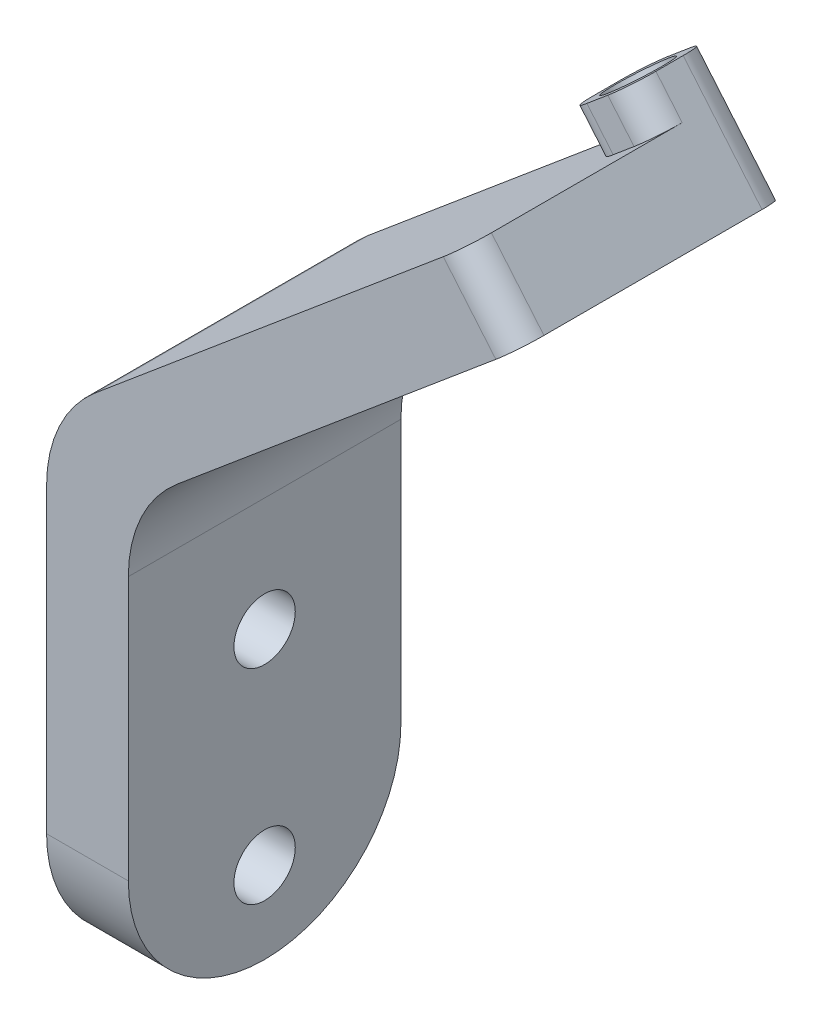
ISO-10303-21;
HEADER;
FILE_DESCRIPTION(('STEP AP214'),'2;1');
FILE_NAME('part.step','',(''),(''),'','','');
FILE_SCHEMA(('AUTOMOTIVE_DESIGN { 1 0 10303 214 1 1 1 1 }'));
ENDSEC;
DATA;
#1=APPLICATION_CONTEXT('core data for automotive mechanical design processes');
#2=APPLICATION_PROTOCOL_DEFINITION('international standard','automotive_design',2000,#1);
#3=PRODUCT_CONTEXT('',#1,'mechanical');
#4=PRODUCT('Part','Part','',(#3));
#5=PRODUCT_RELATED_PRODUCT_CATEGORY('part','',(#4));
#6=PRODUCT_DEFINITION_FORMATION('','',#4);
#7=PRODUCT_DEFINITION_CONTEXT('part definition',#1,'design');
#8=PRODUCT_DEFINITION('design','',#6,#7);
#9=PRODUCT_DEFINITION_SHAPE('','',#8);
#10=(LENGTH_UNIT() NAMED_UNIT(*) SI_UNIT(.MILLI.,.METRE.));
#11=(NAMED_UNIT(*) PLANE_ANGLE_UNIT() SI_UNIT($,.RADIAN.));
#12=(NAMED_UNIT(*) SI_UNIT($,.STERADIAN.) SOLID_ANGLE_UNIT());
#13=UNCERTAINTY_MEASURE_WITH_UNIT(LENGTH_MEASURE(1.E-05),#10,'distance_accuracy_value','');
#14=(GEOMETRIC_REPRESENTATION_CONTEXT(3) GLOBAL_UNCERTAINTY_ASSIGNED_CONTEXT((#13)) GLOBAL_UNIT_ASSIGNED_CONTEXT((#10,
#11,#12)) REPRESENTATION_CONTEXT('',''));
#15=CARTESIAN_POINT('',(0.,0.,0.));
#16=DIRECTION('',(0.,0.,1.));
#17=DIRECTION('',(1.,0.,0.));
#18=AXIS2_PLACEMENT_3D('',#15,#16,#17);
#19=CARTESIAN_POINT('',(0.,36.79784594893,20.));
#20=DIRECTION('',(0.642787609686538,-0.766044443118979,0.));
#21=DIRECTION('',(0.766044443118979,0.642787609686538,0.));
#22=AXIS2_PLACEMENT_3D('',#19,#20,#21);
#23=PLANE('',#22);
#24=DIRECTION('',(-0.766044443118979,-0.642787609686538,0.));
#25=VECTOR('',#24,1.);
#26=CARTESIAN_POINT('',(0.,36.79784594893,20.));
#27=LINE('',#26,#25);
#28=CARTESIAN_POINT('',(29.1096888385212,61.2237751170184,20.));
#29=VERTEX_POINT('',#28);
#30=CARTESIAN_POINT('',(3.57212390313463,39.7952137985698,20.));
#31=VERTEX_POINT('',#30);
#32=EDGE_CURVE('E310',#29,#31,#27,.T.);
#33=ORIENTED_EDGE('',*,*,#32,.F.);
#34=CARTESIAN_POINT('',(29.1096888385212,61.2237751170184,18.));
#35=DIRECTION('',(0.642787609686538,-0.766044443118979,0.));
#36=DIRECTION('',(0.766044443118979,0.642787609686538,0.));
#37=AXIS2_PLACEMENT_3D('',#34,#35,#36);
#38=CIRCLE('',#37,2.);
#39=CARTESIAN_POINT('',(30.6417777247592,62.5093503363915,18.));
#40=VERTEX_POINT('',#39);
#41=EDGE_CURVE('E47',#29,#40,#38,.F.);
#42=ORIENTED_EDGE('',*,*,#41,.T.);
#43=DIRECTION('',(0.,0.,-1.));
#44=VECTOR('',#43,1.);
#45=CARTESIAN_POINT('',(30.6417777247592,62.5093503363915,20.));
#46=LINE('',#45,#44);
#47=CARTESIAN_POINT('',(30.6417777247592,62.5093503363915,4.));
#48=VERTEX_POINT('',#47);
#49=EDGE_CURVE('E191',#40,#48,#46,.T.);
#50=ORIENTED_EDGE('',*,*,#49,.T.);
#51=CARTESIAN_POINT('',(29.1096888385212,61.2237751170184,4.));
#52=DIRECTION('',(0.642787609686538,-0.766044443118979,0.));
#53=DIRECTION('',(0.766044443118979,0.642787609686538,0.));
#54=AXIS2_PLACEMENT_3D('',#51,#52,#53);
#55=CIRCLE('',#54,2.);
#56=CARTESIAN_POINT('',(29.1096888385212,61.2237751170184,6.));
#57=VERTEX_POINT('',#56);
#58=EDGE_CURVE('E261',#48,#57,#55,.T.);
#59=ORIENTED_EDGE('',*,*,#58,.T.);
#60=DIRECTION('',(0.766044443118979,0.642787609686538,0.));
#61=VECTOR('',#60,1.);
#62=CARTESIAN_POINT('',(30.6417777247592,62.5093503363915,6.));
#63=LINE('',#62,#61);
#64=CARTESIAN_POINT('',(27.5775999522833,59.9381998976453,6.));
#65=VERTEX_POINT('',#64);
#66=EDGE_CURVE('E287',#65,#57,#63,.T.);
#67=ORIENTED_EDGE('',*,*,#66,.F.);
#68=CARTESIAN_POINT('',(27.5775999522833,59.9381998976454,4.));
#69=DIRECTION('',(0.642787609686538,-0.766044443118979,0.));
#70=DIRECTION('',(0.766044443118979,0.642787609686538,0.));
#71=AXIS2_PLACEMENT_3D('',#68,#69,#70);
#72=CIRCLE('',#71,2.);
#73=CARTESIAN_POINT('',(26.0455110660453,58.6526246782723,4.));
#74=VERTEX_POINT('',#73);
#75=EDGE_CURVE('E11',#65,#74,#72,.T.);
#76=ORIENTED_EDGE('',*,*,#75,.T.);
#77=DIRECTION('',(0.,0.,1.));
#78=VECTOR('',#77,1.);
#79=CARTESIAN_POINT('',(26.0455110660453,58.6526246782723,6.));
#80=LINE('',#79,#78);
#81=CARTESIAN_POINT('',(26.0455110660453,58.6526246782723,2.));
#82=VERTEX_POINT('',#81);
#83=EDGE_CURVE('E269',#82,#74,#80,.T.);
#84=ORIENTED_EDGE('',*,*,#83,.F.);
#85=CARTESIAN_POINT('',(27.5775999522833,59.9381998976454,2.));
#86=DIRECTION('',(0.642787609686538,-0.766044443118979,0.));
#87=DIRECTION('',(0.766044443118979,0.642787609686538,0.));
#88=AXIS2_PLACEMENT_3D('',#85,#86,#87);
#89=CIRCLE('',#88,2.);
#90=CARTESIAN_POINT('',(27.5775999522833,59.9381998976454,0.));
#91=VERTEX_POINT('',#90);
#92=EDGE_CURVE('E40',#82,#91,#89,.T.);
#93=ORIENTED_EDGE('',*,*,#92,.T.);
#94=DIRECTION('',(-0.766044443118979,-0.642787609686538,0.));
#95=VECTOR('',#94,1.);
#96=CARTESIAN_POINT('',(0.,36.79784594893,0.));
#97=LINE('',#96,#95);
#98=CARTESIAN_POINT('',(3.57212390313463,39.7952137985698,0.));
#99=VERTEX_POINT('',#98);
#100=EDGE_CURVE('E178',#91,#99,#97,.T.);
#101=ORIENTED_EDGE('',*,*,#100,.T.);
#102=DIRECTION('',(0.,0.,-1.));
#103=VECTOR('',#102,1.);
#104=CARTESIAN_POINT('',(3.57212390313463,39.7952137985698,20.));
#105=LINE('',#104,#103);
#106=EDGE_CURVE('E217',#99,#31,#105,.F.);
#107=ORIENTED_EDGE('',*,*,#106,.T.);
#108=EDGE_LOOP('',(#33,#42,#50,#59,#67,#76,#84,#93,#101,#107));
#109=FACE_BOUND('',#108,.T.);
#110=ADVANCED_FACE('F32',(#109),#23,.F.);
#111=CARTESIAN_POINT('',(6.,34.,20.));
#112=DIRECTION('',(-1.,0.,0.));
#113=DIRECTION('',(0.,-1.,0.));
#114=AXIS2_PLACEMENT_3D('',#111,#112,#113);
#115=PLANE('',#114);
#116=CARTESIAN_POINT('',(6.,21.,10.));
#117=DIRECTION('',(-1.,0.,0.));
#118=DIRECTION('',(0.,-1.,0.));
#119=AXIS2_PLACEMENT_3D('',#116,#117,#118);
#120=CIRCLE('',#119,2.25);
#121=CARTESIAN_POINT('',(6.,18.75,10.));
#122=VERTEX_POINT('',#121);
#123=EDGE_CURVE('E299',#122,#122,#120,.T.);
#124=ORIENTED_EDGE('',*,*,#123,.T.);
#125=EDGE_LOOP('',(#124));
#126=FACE_BOUND('',#125,.T.);
#127=CARTESIAN_POINT('',(6.,6.,10.));
#128=DIRECTION('',(-1.,0.,0.));
#129=DIRECTION('',(0.,-1.,0.));
#130=AXIS2_PLACEMENT_3D('',#127,#128,#129);
#131=CIRCLE('',#130,2.25);
#132=CARTESIAN_POINT('',(6.,3.75,10.));
#133=VERTEX_POINT('',#132);
#134=EDGE_CURVE('E184',#133,#133,#131,.T.);
#135=ORIENTED_EDGE('',*,*,#134,.T.);
#136=EDGE_LOOP('',(#135));
#137=FACE_BOUND('',#136,.T.);
#138=DIRECTION('',(0.,1.,0.));
#139=VECTOR('',#138,1.);
#140=CARTESIAN_POINT('',(6.,34.,0.));
#141=LINE('',#140,#139);
#142=CARTESIAN_POINT('',(6.,10.,0.));
#143=VERTEX_POINT('',#142);
#144=CARTESIAN_POINT('',(6.,29.33692341845,0.));
#145=VERTEX_POINT('',#144);
#146=EDGE_CURVE('E179',#143,#145,#141,.T.);
#147=ORIENTED_EDGE('',*,*,#146,.T.);
#148=DIRECTION('',(0.,0.,-1.));
#149=VECTOR('',#148,1.);
#150=CARTESIAN_POINT('',(6.,29.33692341845,20.));
#151=LINE('',#150,#149);
#152=CARTESIAN_POINT('',(6.,29.33692341845,20.));
#153=VERTEX_POINT('',#152);
#154=EDGE_CURVE('E158',#145,#153,#151,.F.);
#155=ORIENTED_EDGE('',*,*,#154,.T.);
#156=DIRECTION('',(0.,1.,0.));
#157=VECTOR('',#156,1.);
#158=CARTESIAN_POINT('',(6.,34.,20.));
#159=LINE('',#158,#157);
#160=CARTESIAN_POINT('',(6.,10.,20.));
#161=VERTEX_POINT('',#160);
#162=EDGE_CURVE('E190',#161,#153,#159,.T.);
#163=ORIENTED_EDGE('',*,*,#162,.F.);
#164=CARTESIAN_POINT('',(6.,10.,10.));
#165=DIRECTION('',(-1.,0.,0.));
#166=DIRECTION('',(0.,-1.,0.));
#167=AXIS2_PLACEMENT_3D('',#164,#165,#166);
#168=CIRCLE('',#167,10.);
#169=CARTESIAN_POINT('',(6.,0.,10.));
#170=VERTEX_POINT('',#169);
#171=EDGE_CURVE('E171',#161,#170,#168,.F.);
#172=ORIENTED_EDGE('',*,*,#171,.T.);
#173=CARTESIAN_POINT('',(6.,10.,10.));
#174=DIRECTION('',(-1.,0.,0.));
#175=DIRECTION('',(0.,-1.,0.));
#176=AXIS2_PLACEMENT_3D('',#173,#174,#175);
#177=CIRCLE('',#176,10.);
#178=EDGE_CURVE('E202',#170,#143,#177,.F.);
#179=ORIENTED_EDGE('',*,*,#178,.T.);
#180=EDGE_LOOP('',(#147,#155,#163,#172,#179));
#181=FACE_BOUND('',#180,.T.);
#182=ADVANCED_FACE('F327',(#126,#137,#181),#115,.F.);
#183=CARTESIAN_POINT('',(34.4985033828784,57.9130836776776,20.));
#184=DIRECTION('',(-0.642787609686538,0.766044443118979,0.));
#185=DIRECTION('',(-0.766044443118979,-0.642787609686538,0.));
#186=AXIS2_PLACEMENT_3D('',#183,#184,#185);
#187=PLANE('',#186);
#188=CARTESIAN_POINT('',(32.2003700535215,55.9847208486181,3.));
#189=DIRECTION('',(-0.642787609686538,0.766044443118979,0.));
#190=DIRECTION('',(-0.766044443118979,-0.642787609686538,0.));
#191=AXIS2_PLACEMENT_3D('',#188,#189,#190);
#192=CIRCLE('',#191,1.75);
#193=CARTESIAN_POINT('',(30.8597922780633,54.8598425316666,3.));
#194=VERTEX_POINT('',#193);
#195=EDGE_CURVE('E198',#194,#194,#192,.T.);
#196=ORIENTED_EDGE('',*,*,#195,.T.);
#197=EDGE_LOOP('',(#196));
#198=FACE_BOUND('',#197,.T.);
#199=DIRECTION('',(0.766044443118979,0.642787609686538,0.));
#200=VECTOR('',#199,1.);
#201=CARTESIAN_POINT('',(34.4985033828784,57.9130836776776,0.));
#202=LINE('',#201,#200);
#203=CARTESIAN_POINT('',(9.57212390313463,36.9973678496398,0.));
#204=VERTEX_POINT('',#203);
#205=CARTESIAN_POINT('',(32.9664144966404,56.6275084583046,0.));
#206=VERTEX_POINT('',#205);
#207=EDGE_CURVE('E168',#204,#206,#202,.T.);
#208=ORIENTED_EDGE('',*,*,#207,.T.);
#209=CARTESIAN_POINT('',(32.9664144966404,56.6275084583046,2.));
#210=DIRECTION('',(-0.642787609686538,0.766044443118979,0.));
#211=DIRECTION('',(-0.766044443118979,-0.642787609686538,0.));
#212=AXIS2_PLACEMENT_3D('',#209,#210,#211);
#213=CIRCLE('',#212,2.);
#214=CARTESIAN_POINT('',(34.4985033828784,57.9130836776776,2.));
#215=VERTEX_POINT('',#214);
#216=EDGE_CURVE('E256',#206,#215,#213,.F.);
#217=ORIENTED_EDGE('',*,*,#216,.T.);
#218=DIRECTION('',(0.,0.,-1.));
#219=VECTOR('',#218,1.);
#220=CARTESIAN_POINT('',(34.4985033828784,57.9130836776776,20.));
#221=LINE('',#220,#219);
#222=CARTESIAN_POINT('',(34.4985033828784,57.9130836776776,18.));
#223=VERTEX_POINT('',#222);
#224=EDGE_CURVE('E172',#223,#215,#221,.T.);
#225=ORIENTED_EDGE('',*,*,#224,.F.);
#226=CARTESIAN_POINT('',(32.9664144966404,56.6275084583046,18.));
#227=DIRECTION('',(-0.642787609686538,0.766044443118979,0.));
#228=DIRECTION('',(-0.766044443118979,-0.642787609686538,0.));
#229=AXIS2_PLACEMENT_3D('',#226,#227,#228);
#230=CIRCLE('',#229,2.);
#231=CARTESIAN_POINT('',(32.9664144966404,56.6275084583046,20.));
#232=VERTEX_POINT('',#231);
#233=EDGE_CURVE('E55',#223,#232,#230,.F.);
#234=ORIENTED_EDGE('',*,*,#233,.T.);
#235=DIRECTION('',(0.766044443118979,0.642787609686538,0.));
#236=VECTOR('',#235,1.);
#237=CARTESIAN_POINT('',(34.4985033828784,57.9130836776776,20.));
#238=LINE('',#237,#236);
#239=CARTESIAN_POINT('',(9.57212390313463,36.9973678496398,20.));
#240=VERTEX_POINT('',#239);
#241=EDGE_CURVE('E170',#240,#232,#238,.T.);
#242=ORIENTED_EDGE('',*,*,#241,.F.);
#243=DIRECTION('',(0.,0.,-1.));
#244=VECTOR('',#243,1.);
#245=CARTESIAN_POINT('',(9.57212390313463,36.9973678496398,0.));
#246=LINE('',#245,#244);
#247=EDGE_CURVE('E157',#240,#204,#246,.T.);
#248=ORIENTED_EDGE('',*,*,#247,.T.);
#249=EDGE_LOOP('',(#208,#217,#225,#234,#242,#248));
#250=FACE_BOUND('',#249,.T.);
#251=ADVANCED_FACE('F167',(#198,#250),#187,.F.);
#252=CARTESIAN_POINT('',(30.6417777247592,62.5093503363915,20.));
#253=DIRECTION('',(-0.76604444311898,-0.642787609686537,0.));
#254=DIRECTION('',(0.642787609686537,-0.76604444311898,0.));
#255=AXIS2_PLACEMENT_3D('',#252,#253,#254);
#256=PLANE('',#255);
#257=DIRECTION('',(0.,0.,-1.));
#258=VECTOR('',#257,1.);
#259=CARTESIAN_POINT('',(28.7134148956996,64.8074836657484,6.));
#260=LINE('',#259,#258);
#261=CARTESIAN_POINT('',(28.7134148956996,64.8074836657484,4.));
#262=VERTEX_POINT('',#261);
#263=CARTESIAN_POINT('',(28.7134148956996,64.8074836657484,2.));
#264=VERTEX_POINT('',#263);
#265=EDGE_CURVE('E283',#262,#264,#260,.T.);
#266=ORIENTED_EDGE('',*,*,#265,.F.);
#267=DIRECTION('',(0.642787609686537,-0.76604444311898,0.));
#268=VECTOR('',#267,1.);
#269=CARTESIAN_POINT('',(30.6417777247592,62.5093503363915,4.));
#270=LINE('',#269,#268);
#271=EDGE_CURVE('E231',#262,#48,#270,.T.);
#272=ORIENTED_EDGE('',*,*,#271,.T.);
#273=ORIENTED_EDGE('',*,*,#49,.F.);
#274=DIRECTION('',(-0.642787609686537,0.76604444311898,0.));
#275=VECTOR('',#274,1.);
#276=CARTESIAN_POINT('',(30.6417777247592,62.5093503363915,18.));
#277=LINE('',#276,#275);
#278=EDGE_CURVE('E224',#40,#223,#277,.F.);
#279=ORIENTED_EDGE('',*,*,#278,.T.);
#280=ORIENTED_EDGE('',*,*,#224,.T.);
#281=DIRECTION('',(-0.642787609686537,0.76604444311898,0.));
#282=VECTOR('',#281,1.);
#283=CARTESIAN_POINT('',(28.7134148956996,64.8074836657484,2.));
#284=LINE('',#283,#282);
#285=EDGE_CURVE('E228',#215,#264,#284,.T.);
#286=ORIENTED_EDGE('',*,*,#285,.T.);
#287=EDGE_LOOP('',(#266,#272,#273,#279,#280,#286));
#288=FACE_BOUND('',#287,.T.);
#289=ADVANCED_FACE('F331',(#288),#256,.F.);
#290=CARTESIAN_POINT('',(0.,0.,20.));
#291=DIRECTION('',(1.,0.,0.));
#292=DIRECTION('',(0.,0.,-1.));
#293=AXIS2_PLACEMENT_3D('',#290,#291,#292);
#294=PLANE('',#293);
#295=CARTESIAN_POINT('',(0.,21.,10.));
#296=DIRECTION('',(1.,0.,0.));
#297=DIRECTION('',(0.,1.,0.));
#298=AXIS2_PLACEMENT_3D('',#295,#296,#297);
#299=CIRCLE('',#298,2.25);
#300=CARTESIAN_POINT('',(0.,23.25,10.));
#301=VERTEX_POINT('',#300);
#302=EDGE_CURVE('E292',#301,#301,#299,.T.);
#303=ORIENTED_EDGE('',*,*,#302,.T.);
#304=EDGE_LOOP('',(#303));
#305=FACE_BOUND('',#304,.T.);
#306=CARTESIAN_POINT('',(0.,6.,10.));
#307=DIRECTION('',(1.,0.,0.));
#308=DIRECTION('',(0.,1.,0.));
#309=AXIS2_PLACEMENT_3D('',#306,#307,#308);
#310=CIRCLE('',#309,2.25);
#311=CARTESIAN_POINT('',(0.,8.25,10.));
#312=VERTEX_POINT('',#311);
#313=EDGE_CURVE('E302',#312,#312,#310,.T.);
#314=ORIENTED_EDGE('',*,*,#313,.T.);
#315=EDGE_LOOP('',(#314));
#316=FACE_BOUND('',#315,.T.);
#317=DIRECTION('',(0.,-1.,0.));
#318=VECTOR('',#317,1.);
#319=CARTESIAN_POINT('',(0.,0.,20.));
#320=LINE('',#319,#318);
#321=CARTESIAN_POINT('',(0.,32.13476936738,20.));
#322=VERTEX_POINT('',#321);
#323=CARTESIAN_POINT('',(0.,10.,20.));
#324=VERTEX_POINT('',#323);
#325=EDGE_CURVE('E193',#322,#324,#320,.T.);
#326=ORIENTED_EDGE('',*,*,#325,.F.);
#327=DIRECTION('',(0.,0.,-1.));
#328=VECTOR('',#327,1.);
#329=CARTESIAN_POINT('',(0.,32.13476936738,20.));
#330=LINE('',#329,#328);
#331=CARTESIAN_POINT('',(0.,32.13476936738,0.));
#332=VERTEX_POINT('',#331);
#333=EDGE_CURVE('E209',#322,#332,#330,.T.);
#334=ORIENTED_EDGE('',*,*,#333,.T.);
#335=DIRECTION('',(0.,-1.,0.));
#336=VECTOR('',#335,1.);
#337=CARTESIAN_POINT('',(0.,0.,0.));
#338=LINE('',#337,#336);
#339=CARTESIAN_POINT('',(0.,10.,0.));
#340=VERTEX_POINT('',#339);
#341=EDGE_CURVE('E182',#332,#340,#338,.T.);
#342=ORIENTED_EDGE('',*,*,#341,.T.);
#343=CARTESIAN_POINT('',(0.,10.,10.));
#344=DIRECTION('',(1.,0.,0.));
#345=DIRECTION('',(0.,0.,-1.));
#346=AXIS2_PLACEMENT_3D('',#343,#344,#345);
#347=CIRCLE('',#346,10.);
#348=CARTESIAN_POINT('',(0.,0.,10.));
#349=VERTEX_POINT('',#348);
#350=EDGE_CURVE('E207',#340,#349,#347,.F.);
#351=ORIENTED_EDGE('',*,*,#350,.T.);
#352=CARTESIAN_POINT('',(0.,10.,10.));
#353=DIRECTION('',(1.,0.,0.));
#354=DIRECTION('',(0.,0.,-1.));
#355=AXIS2_PLACEMENT_3D('',#352,#353,#354);
#356=CIRCLE('',#355,10.);
#357=EDGE_CURVE('E205',#349,#324,#356,.F.);
#358=ORIENTED_EDGE('',*,*,#357,.T.);
#359=EDGE_LOOP('',(#326,#334,#342,#351,#358));
#360=FACE_BOUND('',#359,.T.);
#361=ADVANCED_FACE('F372',(#305,#316,#360),#294,.F.);
#362=CARTESIAN_POINT('',(0.,0.,20.));
#363=DIRECTION('',(0.,0.,-1.));
#364=DIRECTION('',(-1.,0.,0.));
#365=AXIS2_PLACEMENT_3D('',#362,#363,#364);
#366=PLANE('',#365);
#367=ORIENTED_EDGE('',*,*,#241,.T.);
#368=DIRECTION('',(-0.642787609686537,0.76604444311898,0.));
#369=VECTOR('',#368,1.);
#370=CARTESIAN_POINT('',(47.2290908308488,39.6299126970032,20.));
#371=LINE('',#370,#369);
#372=EDGE_CURVE('E258',#232,#29,#371,.T.);
#373=ORIENTED_EDGE('',*,*,#372,.T.);
#374=ORIENTED_EDGE('',*,*,#32,.T.);
#375=CARTESIAN_POINT('',(10.,32.13476936738,20.));
#376=DIRECTION('',(0.,0.,-1.));
#377=DIRECTION('',(-1.,0.,0.));
#378=AXIS2_PLACEMENT_3D('',#375,#376,#377);
#379=CIRCLE('',#378,10.);
#380=EDGE_CURVE('E164',#31,#322,#379,.F.);
#381=ORIENTED_EDGE('',*,*,#380,.T.);
#382=ORIENTED_EDGE('',*,*,#325,.T.);
#383=DIRECTION('',(1.,0.,0.));
#384=VECTOR('',#383,1.);
#385=CARTESIAN_POINT('',(0.,10.,20.));
#386=LINE('',#385,#384);
#387=EDGE_CURVE('E220',#324,#161,#386,.T.);
#388=ORIENTED_EDGE('',*,*,#387,.T.);
#389=ORIENTED_EDGE('',*,*,#162,.T.);
#390=CARTESIAN_POINT('',(16.,29.33692341845,20.));
#391=DIRECTION('',(0.,0.,-1.));
#392=DIRECTION('',(-1.,0.,0.));
#393=AXIS2_PLACEMENT_3D('',#390,#391,#392);
#394=CIRCLE('',#393,10.);
#395=EDGE_CURVE('E163',#153,#240,#394,.T.);
#396=ORIENTED_EDGE('',*,*,#395,.T.);
#397=EDGE_LOOP('',(#367,#373,#374,#381,#382,#388,#389,#396));
#398=FACE_BOUND('',#397,.T.);
#399=ADVANCED_FACE('F315',(#398),#366,.F.);
#400=CARTESIAN_POINT('',(0.,0.,0.));
#401=DIRECTION('',(0.,0.,-1.));
#402=DIRECTION('',(-1.,0.,0.));
#403=AXIS2_PLACEMENT_3D('',#400,#401,#402);
#404=PLANE('',#403);
#405=ORIENTED_EDGE('',*,*,#100,.F.);
#406=DIRECTION('',(0.642787609686537,-0.76604444311898,0.));
#407=VECTOR('',#406,1.);
#408=CARTESIAN_POINT('',(25.6492371232237,62.2363332270023,0.));
#409=LINE('',#408,#407);
#410=CARTESIAN_POINT('',(25.6492371232237,62.2363332270023,0.));
#411=VERTEX_POINT('',#410);
#412=EDGE_CURVE('E253',#91,#411,#409,.F.);
#413=ORIENTED_EDGE('',*,*,#412,.T.);
#414=DIRECTION('',(-0.766044443118979,-0.642787609686538,0.));
#415=VECTOR('',#414,1.);
#416=CARTESIAN_POINT('',(28.7134148956996,64.8074836657484,0.));
#417=LINE('',#416,#415);
#418=CARTESIAN_POINT('',(27.1813260094616,63.5219084463754,0.));
#419=VERTEX_POINT('',#418);
#420=EDGE_CURVE('E275',#419,#411,#417,.T.);
#421=ORIENTED_EDGE('',*,*,#420,.F.);
#422=DIRECTION('',(-0.642787609686537,0.76604444311898,0.));
#423=VECTOR('',#422,1.);
#424=CARTESIAN_POINT('',(32.9664144966404,56.6275084583046,0.));
#425=LINE('',#424,#423);
#426=EDGE_CURVE('E177',#419,#206,#425,.F.);
#427=ORIENTED_EDGE('',*,*,#426,.T.);
#428=ORIENTED_EDGE('',*,*,#207,.F.);
#429=CARTESIAN_POINT('',(16.,29.33692341845,0.));
#430=DIRECTION('',(0.,0.,-1.));
#431=DIRECTION('',(-1.,0.,0.));
#432=AXIS2_PLACEMENT_3D('',#429,#430,#431);
#433=CIRCLE('',#432,10.);
#434=EDGE_CURVE('E153',#204,#145,#433,.F.);
#435=ORIENTED_EDGE('',*,*,#434,.T.);
#436=ORIENTED_EDGE('',*,*,#146,.F.);
#437=DIRECTION('',(1.,0.,0.));
#438=VECTOR('',#437,1.);
#439=CARTESIAN_POINT('',(0.,10.,0.));
#440=LINE('',#439,#438);
#441=EDGE_CURVE('E212',#143,#340,#440,.F.);
#442=ORIENTED_EDGE('',*,*,#441,.T.);
#443=ORIENTED_EDGE('',*,*,#341,.F.);
#444=CARTESIAN_POINT('',(10.,32.13476936738,0.));
#445=DIRECTION('',(0.,0.,-1.));
#446=DIRECTION('',(-1.,0.,0.));
#447=AXIS2_PLACEMENT_3D('',#444,#445,#446);
#448=CIRCLE('',#447,10.);
#449=EDGE_CURVE('E215',#332,#99,#448,.T.);
#450=ORIENTED_EDGE('',*,*,#449,.T.);
#451=EDGE_LOOP('',(#405,#413,#421,#427,#428,#435,#436,#442,#443,#450));
#452=FACE_BOUND('',#451,.T.);
#453=ADVANCED_FACE('F174',(#452),#404,.T.);
#454=CARTESIAN_POINT('',(0.,6.,10.));
#455=DIRECTION('',(1.,0.,0.));
#456=DIRECTION('',(0.,1.,0.));
#457=AXIS2_PLACEMENT_3D('',#454,#455,#456);
#458=CYLINDRICAL_SURFACE('',#457,2.25);
#459=ORIENTED_EDGE('',*,*,#313,.F.);
#460=EDGE_LOOP('',(#459));
#461=FACE_BOUND('',#460,.T.);
#462=ORIENTED_EDGE('',*,*,#134,.F.);
#463=EDGE_LOOP('',(#462));
#464=FACE_BOUND('',#463,.T.);
#465=ADVANCED_FACE('F360',(#461,#464),#458,.F.);
#466=CARTESIAN_POINT('',(0.,21.,10.));
#467=DIRECTION('',(1.,0.,0.));
#468=DIRECTION('',(0.,1.,0.));
#469=AXIS2_PLACEMENT_3D('',#466,#467,#468);
#470=CYLINDRICAL_SURFACE('',#469,2.25);
#471=ORIENTED_EDGE('',*,*,#302,.F.);
#472=EDGE_LOOP('',(#471));
#473=FACE_BOUND('',#472,.T.);
#474=ORIENTED_EDGE('',*,*,#123,.F.);
#475=EDGE_LOOP('',(#474));
#476=FACE_BOUND('',#475,.T.);
#477=ADVANCED_FACE('F353',(#473,#476),#470,.F.);
#478=CARTESIAN_POINT('',(24.1171482369857,60.9507580076292,6.));
#479=DIRECTION('',(0.76604444311898,0.642787609686537,0.));
#480=DIRECTION('',(-0.642787609686537,0.76604444311898,0.));
#481=AXIS2_PLACEMENT_3D('',#478,#479,#480);
#482=PLANE('',#481);
#483=DIRECTION('',(0.,0.,1.));
#484=VECTOR('',#483,1.);
#485=CARTESIAN_POINT('',(24.1171482369857,60.9507580076292,6.));
#486=LINE('',#485,#484);
#487=CARTESIAN_POINT('',(24.1171482369857,60.9507580076292,2.));
#488=VERTEX_POINT('',#487);
#489=CARTESIAN_POINT('',(24.1171482369857,60.9507580076292,4.));
#490=VERTEX_POINT('',#489);
#491=EDGE_CURVE('E282',#488,#490,#486,.T.);
#492=ORIENTED_EDGE('',*,*,#491,.F.);
#493=DIRECTION('',(0.642787609686537,-0.76604444311898,0.));
#494=VECTOR('',#493,1.);
#495=CARTESIAN_POINT('',(26.0455110660453,58.6526246782723,2.));
#496=LINE('',#495,#494);
#497=EDGE_CURVE('E249',#488,#82,#496,.T.);
#498=ORIENTED_EDGE('',*,*,#497,.T.);
#499=ORIENTED_EDGE('',*,*,#83,.T.);
#500=DIRECTION('',(0.642787609686537,-0.76604444311898,0.));
#501=VECTOR('',#500,1.);
#502=CARTESIAN_POINT('',(24.1171482369857,60.9507580076292,4.));
#503=LINE('',#502,#501);
#504=EDGE_CURVE('E247',#74,#490,#503,.F.);
#505=ORIENTED_EDGE('',*,*,#504,.T.);
#506=EDGE_LOOP('',(#492,#498,#499,#505));
#507=FACE_BOUND('',#506,.T.);
#508=ADVANCED_FACE('F351',(#507),#482,.F.);
#509=CARTESIAN_POINT('',(28.7134148956996,64.8074836657484,6.));
#510=DIRECTION('',(0.,0.,-1.));
#511=DIRECTION('',(-1.,0.,0.));
#512=AXIS2_PLACEMENT_3D('',#509,#510,#511);
#513=PLANE('',#512);
#514=ORIENTED_EDGE('',*,*,#66,.T.);
#515=DIRECTION('',(0.642787609686537,-0.76604444311898,0.));
#516=VECTOR('',#515,1.);
#517=CARTESIAN_POINT('',(27.1813260094616,63.5219084463754,6.));
#518=LINE('',#517,#516);
#519=CARTESIAN_POINT('',(27.1813260094616,63.5219084463754,6.));
#520=VERTEX_POINT('',#519);
#521=EDGE_CURVE('E237',#57,#520,#518,.F.);
#522=ORIENTED_EDGE('',*,*,#521,.T.);
#523=DIRECTION('',(0.766044443118979,0.642787609686538,0.));
#524=VECTOR('',#523,1.);
#525=CARTESIAN_POINT('',(28.7134148956996,64.8074836657484,6.));
#526=LINE('',#525,#524);
#527=CARTESIAN_POINT('',(25.6492371232237,62.2363332270023,6.));
#528=VERTEX_POINT('',#527);
#529=EDGE_CURVE('E285',#528,#520,#526,.T.);
#530=ORIENTED_EDGE('',*,*,#529,.F.);
#531=DIRECTION('',(0.642787609686537,-0.76604444311898,0.));
#532=VECTOR('',#531,1.);
#533=CARTESIAN_POINT('',(25.6492371232237,62.2363332270023,6.));
#534=LINE('',#533,#532);
#535=EDGE_CURVE('E234',#528,#65,#534,.T.);
#536=ORIENTED_EDGE('',*,*,#535,.T.);
#537=EDGE_LOOP('',(#514,#522,#530,#536));
#538=FACE_BOUND('',#537,.T.);
#539=ADVANCED_FACE('F344',(#538),#513,.F.);
#540=CARTESIAN_POINT('',(-20.0477648213871,23.891995749372,0.));
#541=DIRECTION('',(-0.642787609686538,0.766044443118979,0.));
#542=DIRECTION('',(-0.766044443118979,-0.642787609686538,0.));
#543=AXIS2_PLACEMENT_3D('',#540,#541,#542);
#544=PLANE('',#543);
#545=CARTESIAN_POINT('',(26.4152815663427,62.8791208366888,3.));
#546=DIRECTION('',(-0.642787609686538,0.766044443118979,0.));
#547=DIRECTION('',(-0.766044443118979,-0.642787609686538,0.));
#548=AXIS2_PLACEMENT_3D('',#545,#546,#547);
#549=CIRCLE('',#548,2.24999999999998);
#550=CARTESIAN_POINT('',(24.691681569325,61.4328487148941,3.));
#551=VERTEX_POINT('',#550);
#552=EDGE_CURVE('E575',#551,#551,#549,.T.);
#553=ORIENTED_EDGE('',*,*,#552,.F.);
#554=EDGE_LOOP('',(#553));
#555=FACE_BOUND('',#554,.T.);
#556=ORIENTED_EDGE('',*,*,#529,.T.);
#557=CARTESIAN_POINT('',(27.1813260094616,63.5219084463754,4.));
#558=DIRECTION('',(-0.642787609686538,0.766044443118979,0.));
#559=DIRECTION('',(-0.766044443118979,-0.642787609686538,0.));
#560=AXIS2_PLACEMENT_3D('',#557,#558,#559);
#561=CIRCLE('',#560,2.);
#562=EDGE_CURVE('E245',#520,#262,#561,.T.);
#563=ORIENTED_EDGE('',*,*,#562,.T.);
#564=ORIENTED_EDGE('',*,*,#265,.T.);
#565=CARTESIAN_POINT('',(27.1813260094616,63.5219084463754,2.));
#566=DIRECTION('',(-0.642787609686538,0.766044443118979,0.));
#567=DIRECTION('',(-0.766044443118979,-0.642787609686538,0.));
#568=AXIS2_PLACEMENT_3D('',#565,#566,#567);
#569=CIRCLE('',#568,2.);
#570=EDGE_CURVE('E239',#264,#419,#569,.T.);
#571=ORIENTED_EDGE('',*,*,#570,.T.);
#572=ORIENTED_EDGE('',*,*,#420,.T.);
#573=CARTESIAN_POINT('',(25.6492371232237,62.2363332270023,2.));
#574=DIRECTION('',(-0.642787609686538,0.766044443118979,0.));
#575=DIRECTION('',(-0.766044443118979,-0.642787609686538,0.));
#576=AXIS2_PLACEMENT_3D('',#573,#574,#575);
#577=CIRCLE('',#576,2.);
#578=EDGE_CURVE('E243',#411,#488,#577,.T.);
#579=ORIENTED_EDGE('',*,*,#578,.T.);
#580=ORIENTED_EDGE('',*,*,#491,.T.);
#581=CARTESIAN_POINT('',(25.6492371232237,62.2363332270023,4.));
#582=DIRECTION('',(-0.642787609686538,0.766044443118979,0.));
#583=DIRECTION('',(-0.766044443118979,-0.642787609686538,0.));
#584=AXIS2_PLACEMENT_3D('',#581,#582,#583);
#585=CIRCLE('',#584,2.);
#586=EDGE_CURVE('E241',#490,#528,#585,.T.);
#587=ORIENTED_EDGE('',*,*,#586,.T.);
#588=EDGE_LOOP('',(#556,#563,#564,#571,#572,#579,#580,#587));
#589=FACE_BOUND('',#588,.T.);
#590=ADVANCED_FACE('F278',(#555,#589),#544,.T.);
#591=CARTESIAN_POINT('',(29.6292196147754,59.0488986210939,3.));
#592=DIRECTION('',(-0.642787609686538,0.766044443118979,0.));
#593=DIRECTION('',(-0.766044443118979,-0.642787609686538,0.));
#594=AXIS2_PLACEMENT_3D('',#591,#592,#593);
#595=CYLINDRICAL_SURFACE('',#594,2.24999999999998);
#596=CARTESIAN_POINT('',(29.6292196147754,59.0488986210939,3.));
#597=DIRECTION('',(-0.642787609686538,0.766044443118979,0.));
#598=DIRECTION('',(-0.766044443118979,-0.642787609686538,0.));
#599=AXIS2_PLACEMENT_3D('',#596,#597,#598);
#600=CIRCLE('',#599,2.24999999999998);
#601=CARTESIAN_POINT('',(27.9056196177577,57.6026264992992,3.));
#602=VERTEX_POINT('',#601);
#603=EDGE_CURVE('E294',#602,#602,#600,.T.);
#604=ORIENTED_EDGE('',*,*,#603,.F.);
#605=EDGE_LOOP('',(#604));
#606=FACE_BOUND('',#605,.T.);
#607=ORIENTED_EDGE('',*,*,#552,.T.);
#608=EDGE_LOOP('',(#607));
#609=FACE_BOUND('',#608,.T.);
#610=ADVANCED_FACE('F435',(#606,#609),#595,.F.);
#611=CARTESIAN_POINT('',(29.6292196147754,59.0488986210939,3.));
#612=DIRECTION('',(-0.642787609686538,0.766044443118979,0.));
#613=DIRECTION('',(-0.766044443118979,-0.642787609686538,0.));
#614=AXIS2_PLACEMENT_3D('',#611,#612,#613);
#615=PLANE('',#614);
#616=CARTESIAN_POINT('',(29.6292196147754,59.0488986210939,3.));
#617=DIRECTION('',(-0.642787609686538,0.766044443118979,0.));
#618=DIRECTION('',(-0.766044443118979,-0.642787609686538,0.));
#619=AXIS2_PLACEMENT_3D('',#616,#617,#618);
#620=CIRCLE('',#619,1.75);
#621=CARTESIAN_POINT('',(28.2886418393172,57.9240203041425,3.));
#622=VERTEX_POINT('',#621);
#623=EDGE_CURVE('E196',#622,#622,#620,.T.);
#624=ORIENTED_EDGE('',*,*,#623,.F.);
#625=EDGE_LOOP('',(#624));
#626=FACE_BOUND('',#625,.T.);
#627=ORIENTED_EDGE('',*,*,#603,.T.);
#628=EDGE_LOOP('',(#627));
#629=FACE_BOUND('',#628,.T.);
#630=ADVANCED_FACE('F529',(#626,#629),#615,.T.);
#631=CARTESIAN_POINT('',(60.7169969568323,21.9999282879286,3.));
#632=DIRECTION('',(-0.642787609686538,0.766044443118979,0.));
#633=DIRECTION('',(-0.766044443118979,-0.642787609686538,0.));
#634=AXIS2_PLACEMENT_3D('',#631,#632,#633);
#635=CYLINDRICAL_SURFACE('',#634,1.75);
#636=ORIENTED_EDGE('',*,*,#623,.T.);
#637=EDGE_LOOP('',(#636));
#638=FACE_BOUND('',#637,.T.);
#639=ORIENTED_EDGE('',*,*,#195,.F.);
#640=EDGE_LOOP('',(#639));
#641=FACE_BOUND('',#640,.T.);
#642=ADVANCED_FACE('F382',(#638,#641),#635,.F.);
#643=CARTESIAN_POINT('',(16.,29.33692341845,20.));
#644=DIRECTION('',(0.,0.,1.));
#645=DIRECTION('',(1.,0.,0.));
#646=AXIS2_PLACEMENT_3D('',#643,#644,#645);
#647=CYLINDRICAL_SURFACE('',#646,10.);
#648=ORIENTED_EDGE('',*,*,#395,.F.);
#649=ORIENTED_EDGE('',*,*,#154,.F.);
#650=ORIENTED_EDGE('',*,*,#434,.F.);
#651=ORIENTED_EDGE('',*,*,#247,.F.);
#652=EDGE_LOOP('',(#648,#649,#650,#651));
#653=FACE_BOUND('',#652,.T.);
#654=ADVANCED_FACE('F156',(#653),#647,.F.);
#655=CARTESIAN_POINT('',(10.,32.13476936738,20.));
#656=DIRECTION('',(0.,0.,-1.));
#657=DIRECTION('',(-1.,0.,0.));
#658=AXIS2_PLACEMENT_3D('',#655,#656,#657);
#659=CYLINDRICAL_SURFACE('',#658,10.);
#660=ORIENTED_EDGE('',*,*,#380,.F.);
#661=ORIENTED_EDGE('',*,*,#106,.F.);
#662=ORIENTED_EDGE('',*,*,#449,.F.);
#663=ORIENTED_EDGE('',*,*,#333,.F.);
#664=EDGE_LOOP('',(#660,#661,#662,#663));
#665=FACE_BOUND('',#664,.T.);
#666=ADVANCED_FACE('F381',(#665),#659,.T.);
#667=CARTESIAN_POINT('',(0.,10.,10.));
#668=DIRECTION('',(1.,0.,0.));
#669=DIRECTION('',(0.,1.,0.));
#670=AXIS2_PLACEMENT_3D('',#667,#668,#669);
#671=CYLINDRICAL_SURFACE('',#670,10.);
#672=ORIENTED_EDGE('',*,*,#387,.F.);
#673=ORIENTED_EDGE('',*,*,#357,.F.);
#674=DIRECTION('',(1.,0.,0.));
#675=VECTOR('',#674,1.);
#676=CARTESIAN_POINT('',(6.,0.,10.));
#677=LINE('',#676,#675);
#678=EDGE_CURVE('E199',#170,#349,#677,.F.);
#679=ORIENTED_EDGE('',*,*,#678,.F.);
#680=ORIENTED_EDGE('',*,*,#171,.F.);
#681=EDGE_LOOP('',(#672,#673,#679,#680));
#682=FACE_BOUND('',#681,.T.);
#683=ADVANCED_FACE('F323',(#682),#671,.T.);
#684=CARTESIAN_POINT('',(6.,10.,10.));
#685=DIRECTION('',(-1.,0.,0.));
#686=DIRECTION('',(0.,-1.,0.));
#687=AXIS2_PLACEMENT_3D('',#684,#685,#686);
#688=CYLINDRICAL_SURFACE('',#687,10.);
#689=ORIENTED_EDGE('',*,*,#350,.F.);
#690=ORIENTED_EDGE('',*,*,#441,.F.);
#691=ORIENTED_EDGE('',*,*,#178,.F.);
#692=ORIENTED_EDGE('',*,*,#678,.T.);
#693=EDGE_LOOP('',(#689,#690,#691,#692));
#694=FACE_BOUND('',#693,.T.);
#695=ADVANCED_FACE('F386',(#694),#688,.T.);
#696=CARTESIAN_POINT('',(29.1096888385212,61.2237751170184,4.));
#697=DIRECTION('',(0.642787609686537,-0.76604444311898,0.));
#698=DIRECTION('',(0.76604444311898,0.642787609686537,0.));
#699=AXIS2_PLACEMENT_3D('',#696,#697,#698);
#700=CYLINDRICAL_SURFACE('',#699,2.);
#701=ORIENTED_EDGE('',*,*,#562,.F.);
#702=ORIENTED_EDGE('',*,*,#521,.F.);
#703=ORIENTED_EDGE('',*,*,#58,.F.);
#704=ORIENTED_EDGE('',*,*,#271,.F.);
#705=EDGE_LOOP('',(#701,#702,#703,#704));
#706=FACE_BOUND('',#705,.T.);
#707=ADVANCED_FACE('F340',(#706),#700,.T.);
#708=CARTESIAN_POINT('',(25.6492371232237,62.2363332270023,2.));
#709=DIRECTION('',(-0.642787609686537,0.76604444311898,0.));
#710=DIRECTION('',(-0.76604444311898,-0.642787609686537,0.));
#711=AXIS2_PLACEMENT_3D('',#708,#709,#710);
#712=CYLINDRICAL_SURFACE('',#711,2.);
#713=ORIENTED_EDGE('',*,*,#578,.F.);
#714=ORIENTED_EDGE('',*,*,#412,.F.);
#715=ORIENTED_EDGE('',*,*,#92,.F.);
#716=ORIENTED_EDGE('',*,*,#497,.F.);
#717=EDGE_LOOP('',(#713,#714,#715,#716));
#718=FACE_BOUND('',#717,.T.);
#719=ADVANCED_FACE('F273',(#718),#712,.T.);
#720=CARTESIAN_POINT('',(25.6492371232237,62.2363332270023,4.));
#721=DIRECTION('',(0.642787609686537,-0.76604444311898,0.));
#722=DIRECTION('',(0.76604444311898,0.642787609686537,0.));
#723=AXIS2_PLACEMENT_3D('',#720,#721,#722);
#724=CYLINDRICAL_SURFACE('',#723,2.);
#725=ORIENTED_EDGE('',*,*,#586,.F.);
#726=ORIENTED_EDGE('',*,*,#504,.F.);
#727=ORIENTED_EDGE('',*,*,#75,.F.);
#728=ORIENTED_EDGE('',*,*,#535,.F.);
#729=EDGE_LOOP('',(#725,#726,#727,#728));
#730=FACE_BOUND('',#729,.T.);
#731=ADVANCED_FACE('F348',(#730),#724,.T.);
#732=CARTESIAN_POINT('',(29.1096888385212,61.2237751170184,2.));
#733=DIRECTION('',(0.642787609686537,-0.76604444311898,0.));
#734=DIRECTION('',(0.76604444311898,0.642787609686537,0.));
#735=AXIS2_PLACEMENT_3D('',#732,#733,#734);
#736=CYLINDRICAL_SURFACE('',#735,2.);
#737=ORIENTED_EDGE('',*,*,#216,.F.);
#738=ORIENTED_EDGE('',*,*,#426,.F.);
#739=ORIENTED_EDGE('',*,*,#570,.F.);
#740=ORIENTED_EDGE('',*,*,#285,.F.);
#741=EDGE_LOOP('',(#737,#738,#739,#740));
#742=FACE_BOUND('',#741,.T.);
#743=ADVANCED_FACE('F334',(#742),#736,.T.);
#744=CARTESIAN_POINT('',(47.2290908308488,39.6299126970032,18.));
#745=DIRECTION('',(-0.642787609686537,0.76604444311898,0.));
#746=DIRECTION('',(-0.76604444311898,-0.642787609686537,0.));
#747=AXIS2_PLACEMENT_3D('',#744,#745,#746);
#748=CYLINDRICAL_SURFACE('',#747,2.);
#749=ORIENTED_EDGE('',*,*,#233,.F.);
#750=ORIENTED_EDGE('',*,*,#278,.F.);
#751=ORIENTED_EDGE('',*,*,#41,.F.);
#752=ORIENTED_EDGE('',*,*,#372,.F.);
#753=EDGE_LOOP('',(#749,#750,#751,#752));
#754=FACE_BOUND('',#753,.T.);
#755=ADVANCED_FACE('F34',(#754),#748,.T.);
#756=CLOSED_SHELL('',(#110,#182,#251,#289,#361,#399,#453,#465,#477,#508,#539,#590,#610,#630,
#642,#654,#666,#683,#695,#707,#719,#731,#743,#755));
#757=MANIFOLD_SOLID_BREP('B2',#756);
#758=ADVANCED_BREP_SHAPE_REPRESENTATION('',(#18,#757),#14);
#759=SHAPE_DEFINITION_REPRESENTATION(#9,#758);
ENDSEC;
END-ISO-10303-21;
